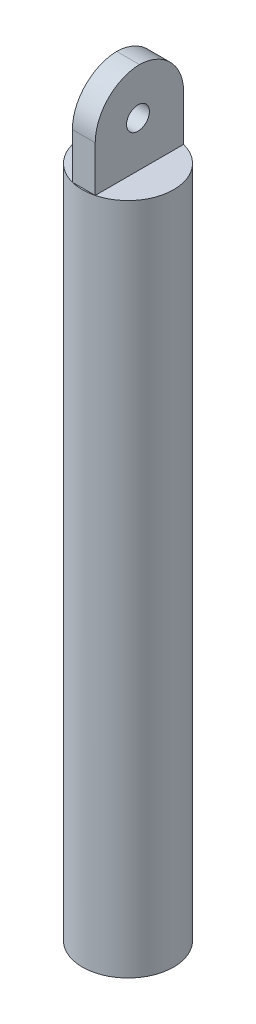
ISO-10303-21;
HEADER;
FILE_DESCRIPTION(('STEP AP214'),'2;1');
FILE_NAME('part.step','',(''),(''),'','','');
FILE_SCHEMA(('AUTOMOTIVE_DESIGN { 1 0 10303 214 1 1 1 1 }'));
ENDSEC;
DATA;
#1=APPLICATION_CONTEXT('core data for automotive mechanical design processes');
#2=APPLICATION_PROTOCOL_DEFINITION('international standard','automotive_design',2000,#1);
#3=PRODUCT_CONTEXT('',#1,'mechanical');
#4=PRODUCT('Part','Part','',(#3));
#5=PRODUCT_RELATED_PRODUCT_CATEGORY('part','',(#4));
#6=PRODUCT_DEFINITION_FORMATION('','',#4);
#7=PRODUCT_DEFINITION_CONTEXT('part definition',#1,'design');
#8=PRODUCT_DEFINITION('design','',#6,#7);
#9=PRODUCT_DEFINITION_SHAPE('','',#8);
#10=(LENGTH_UNIT() NAMED_UNIT(*) SI_UNIT(.MILLI.,.METRE.));
#11=(NAMED_UNIT(*) PLANE_ANGLE_UNIT() SI_UNIT($,.RADIAN.));
#12=(NAMED_UNIT(*) SI_UNIT($,.STERADIAN.) SOLID_ANGLE_UNIT());
#13=UNCERTAINTY_MEASURE_WITH_UNIT(LENGTH_MEASURE(1.E-05),#10,'distance_accuracy_value','');
#14=(GEOMETRIC_REPRESENTATION_CONTEXT(3) GLOBAL_UNCERTAINTY_ASSIGNED_CONTEXT((#13)) GLOBAL_UNIT_ASSIGNED_CONTEXT((#10,
#11,#12)) REPRESENTATION_CONTEXT('',''));
#15=CARTESIAN_POINT('',(0.,0.,0.));
#16=DIRECTION('',(0.,0.,1.));
#17=DIRECTION('',(1.,0.,0.));
#18=AXIS2_PLACEMENT_3D('',#15,#16,#17);
#19=CARTESIAN_POINT('',(0.,190.5,0.));
#20=DIRECTION('',(0.,1.,0.));
#21=DIRECTION('',(0.,0.,1.));
#22=AXIS2_PLACEMENT_3D('',#19,#20,#21);
#23=PLANE('',#22);
#24=DIRECTION('',(0.,0.,1.));
#25=VECTOR('',#24,1.);
#26=CARTESIAN_POINT('',(-6.35,190.5,-24.5934442484171));
#27=LINE('',#26,#25);
#28=CARTESIAN_POINT('',(-6.35000000000001,190.5,-24.5934442484171));
#29=VERTEX_POINT('',#28);
#30=CARTESIAN_POINT('',(-6.35000000000001,190.5,24.5934442484171));
#31=VERTEX_POINT('',#30);
#32=EDGE_CURVE('E176',#29,#31,#27,.T.);
#33=ORIENTED_EDGE('',*,*,#32,.F.);
#34=CARTESIAN_POINT('',(0.,190.5,0.));
#35=DIRECTION('',(0.,1.,0.));
#36=DIRECTION('',(0.,0.,1.));
#37=AXIS2_PLACEMENT_3D('',#34,#35,#36);
#38=CIRCLE('',#37,25.4);
#39=EDGE_CURVE('E171',#29,#31,#38,.T.);
#40=ORIENTED_EDGE('',*,*,#39,.T.);
#41=EDGE_LOOP('',(#33,#40));
#42=FACE_BOUND('',#41,.T.);
#43=ADVANCED_FACE('F33',(#42),#23,.T.);
#44=DIRECTION('',(-1.,0.,0.));
#45=VECTOR('',#44,1.);
#46=CARTESIAN_POINT('',(-6.35,190.5,-24.5934442484171));
#47=LINE('',#46,#45);
#48=CARTESIAN_POINT('',(6.35,190.5,-24.5934442484171));
#49=VERTEX_POINT('',#48);
#50=EDGE_CURVE('E173',#49,#29,#47,.T.);
#51=ORIENTED_EDGE('',*,*,#50,.F.);
#52=EDGE_CURVE('E163',#49,#29,#38,.T.);
#53=ORIENTED_EDGE('',*,*,#52,.T.);
#54=EDGE_LOOP('',(#51,#53));
#55=FACE_BOUND('',#54,.T.);
#56=ADVANCED_FACE('F606',(#55),#23,.T.);
#57=DIRECTION('',(0.,0.,-1.));
#58=VECTOR('',#57,1.);
#59=CARTESIAN_POINT('',(6.35,190.5,-24.5934442484171));
#60=LINE('',#59,#58);
#61=CARTESIAN_POINT('',(6.35,190.5,24.5934442484171));
#62=VERTEX_POINT('',#61);
#63=EDGE_CURVE('E142',#62,#49,#60,.T.);
#64=ORIENTED_EDGE('',*,*,#63,.F.);
#65=EDGE_CURVE('E156',#62,#49,#38,.T.);
#66=ORIENTED_EDGE('',*,*,#65,.T.);
#67=EDGE_LOOP('',(#64,#66));
#68=FACE_BOUND('',#67,.T.);
#69=ADVANCED_FACE('F172',(#68),#23,.T.);
#70=CARTESIAN_POINT('',(0.,-184.15,0.));
#71=DIRECTION('',(0.,1.,0.));
#72=DIRECTION('',(0.,0.,1.));
#73=AXIS2_PLACEMENT_3D('',#70,#71,#72);
#74=PLANE('',#73);
#75=CARTESIAN_POINT('',(0.,-184.15,0.));
#76=DIRECTION('',(0.,1.,0.));
#77=DIRECTION('',(0.,0.,1.));
#78=AXIS2_PLACEMENT_3D('',#75,#76,#77);
#79=CIRCLE('',#78,25.4);
#80=CARTESIAN_POINT('',(0.,-184.15,25.4));
#81=VERTEX_POINT('',#80);
#82=EDGE_CURVE('E194',#81,#81,#79,.T.);
#83=ORIENTED_EDGE('',*,*,#82,.F.);
#84=EDGE_LOOP('',(#83));
#85=FACE_BOUND('',#84,.T.);
#86=CARTESIAN_POINT('',(0.,-184.15,0.));
#87=DIRECTION('',(0.,1.,0.));
#88=DIRECTION('',(0.,0.,1.));
#89=AXIS2_PLACEMENT_3D('',#86,#87,#88);
#90=CIRCLE('',#89,12.7);
#91=CARTESIAN_POINT('',(0.,-184.15,12.7));
#92=VERTEX_POINT('',#91);
#93=EDGE_CURVE('E191',#92,#92,#90,.T.);
#94=ORIENTED_EDGE('',*,*,#93,.T.);
#95=EDGE_LOOP('',(#94));
#96=FACE_BOUND('',#95,.T.);
#97=ADVANCED_FACE('F593',(#85,#96),#74,.F.);
#98=CARTESIAN_POINT('',(0.,184.15,0.));
#99=DIRECTION('',(0.,-1.,0.));
#100=DIRECTION('',(0.,0.,-1.));
#101=AXIS2_PLACEMENT_3D('',#98,#99,#100);
#102=CYLINDRICAL_SURFACE('',#101,25.4);
#103=ORIENTED_EDGE('',*,*,#82,.T.);
#104=EDGE_LOOP('',(#103));
#105=FACE_BOUND('',#104,.T.);
#106=ORIENTED_EDGE('',*,*,#65,.F.);
#107=EDGE_CURVE('E160',#31,#62,#38,.T.);
#108=ORIENTED_EDGE('',*,*,#107,.F.);
#109=ORIENTED_EDGE('',*,*,#39,.F.);
#110=ORIENTED_EDGE('',*,*,#52,.F.);
#111=EDGE_LOOP('',(#106,#108,#109,#110));
#112=FACE_BOUND('',#111,.T.);
#113=ADVANCED_FACE('F158',(#105,#112),#102,.T.);
#114=CARTESIAN_POINT('',(0.,184.15,0.));
#115=DIRECTION('',(0.,-1.,0.));
#116=DIRECTION('',(0.,0.,-1.));
#117=AXIS2_PLACEMENT_3D('',#114,#115,#116);
#118=CYLINDRICAL_SURFACE('',#117,12.7);
#119=CARTESIAN_POINT('',(0.,184.15,0.));
#120=DIRECTION('',(0.,1.,0.));
#121=DIRECTION('',(0.,0.,1.));
#122=AXIS2_PLACEMENT_3D('',#119,#120,#121);
#123=CIRCLE('',#122,12.7);
#124=CARTESIAN_POINT('',(0.,184.15,12.7));
#125=VERTEX_POINT('',#124);
#126=EDGE_CURVE('E165',#125,#125,#123,.T.);
#127=ORIENTED_EDGE('',*,*,#126,.T.);
#128=EDGE_LOOP('',(#127));
#129=FACE_BOUND('',#128,.T.);
#130=ORIENTED_EDGE('',*,*,#93,.F.);
#131=EDGE_LOOP('',(#130));
#132=FACE_BOUND('',#131,.T.);
#133=ADVANCED_FACE('F592',(#129,#132),#118,.F.);
#134=CARTESIAN_POINT('',(0.,184.15,0.));
#135=DIRECTION('',(0.,1.,0.));
#136=DIRECTION('',(0.,0.,1.));
#137=AXIS2_PLACEMENT_3D('',#134,#135,#136);
#138=PLANE('',#137);
#139=ORIENTED_EDGE('',*,*,#126,.F.);
#140=EDGE_LOOP('',(#139));
#141=FACE_BOUND('',#140,.T.);
#142=ADVANCED_FACE('F580',(#141),#138,.F.);
#143=DIRECTION('',(1.,0.,0.));
#144=VECTOR('',#143,1.);
#145=CARTESIAN_POINT('',(-6.35,190.5,24.5934442484171));
#146=LINE('',#145,#144);
#147=EDGE_CURVE('E170',#31,#62,#146,.T.);
#148=ORIENTED_EDGE('',*,*,#147,.F.);
#149=ORIENTED_EDGE('',*,*,#107,.T.);
#150=EDGE_LOOP('',(#148,#149));
#151=FACE_BOUND('',#150,.T.);
#152=ADVANCED_FACE('F169',(#151),#23,.T.);
#153=CARTESIAN_POINT('',(-6.35,241.3,-24.5934442484171));
#154=DIRECTION('',(1.,0.,0.));
#155=DIRECTION('',(0.,0.,-1.));
#156=AXIS2_PLACEMENT_3D('',#153,#154,#155);
#157=PLANE('',#156);
#158=CARTESIAN_POINT('',(-6.35,215.9,0.806555751582905));
#159=DIRECTION('',(1.,0.,0.));
#160=DIRECTION('',(0.,0.,-1.));
#161=AXIS2_PLACEMENT_3D('',#158,#159,#160);
#162=CIRCLE('',#161,6.34999999999999);
#163=CARTESIAN_POINT('',(-6.35,215.9,-5.54344424841709));
#164=VERTEX_POINT('',#163);
#165=EDGE_CURVE('E209',#164,#164,#162,.T.);
#166=ORIENTED_EDGE('',*,*,#165,.T.);
#167=EDGE_LOOP('',(#166));
#168=FACE_BOUND('',#167,.T.);
#169=DIRECTION('',(0.,-1.,0.));
#170=VECTOR('',#169,1.);
#171=CARTESIAN_POINT('',(-6.35,241.3,24.5934442484171));
#172=LINE('',#171,#170);
#173=CARTESIAN_POINT('',(-6.35,215.9,24.5934442484171));
#174=VERTEX_POINT('',#173);
#175=EDGE_CURVE('E149',#174,#31,#172,.T.);
#176=ORIENTED_EDGE('',*,*,#175,.F.);
#177=CARTESIAN_POINT('',(-6.35,215.9,-0.806555751582904));
#178=DIRECTION('',(1.,0.,0.));
#179=DIRECTION('',(0.,0.,-1.));
#180=AXIS2_PLACEMENT_3D('',#177,#178,#179);
#181=CIRCLE('',#180,25.4);
#182=CARTESIAN_POINT('',(-6.35,241.287191018693,0.));
#183=VERTEX_POINT('',#182);
#184=EDGE_CURVE('E107',#174,#183,#181,.F.);
#185=ORIENTED_EDGE('',*,*,#184,.T.);
#186=CARTESIAN_POINT('',(-6.35,215.9,0.806555751582904));
#187=DIRECTION('',(1.,0.,0.));
#188=DIRECTION('',(0.,0.,-1.));
#189=AXIS2_PLACEMENT_3D('',#186,#187,#188);
#190=CIRCLE('',#189,25.4);
#191=CARTESIAN_POINT('',(-6.35,215.9,-24.5934442484171));
#192=VERTEX_POINT('',#191);
#193=EDGE_CURVE('E111',#183,#192,#190,.F.);
#194=ORIENTED_EDGE('',*,*,#193,.T.);
#195=DIRECTION('',(0.,-1.,0.));
#196=VECTOR('',#195,1.);
#197=CARTESIAN_POINT('',(-6.35,241.3,-24.5934442484171));
#198=LINE('',#197,#196);
#199=EDGE_CURVE('E185',#192,#29,#198,.T.);
#200=ORIENTED_EDGE('',*,*,#199,.T.);
#201=ORIENTED_EDGE('',*,*,#32,.T.);
#202=EDGE_LOOP('',(#176,#185,#194,#200,#201));
#203=FACE_BOUND('',#202,.T.);
#204=ADVANCED_FACE('F538',(#168,#203),#157,.F.);
#205=CARTESIAN_POINT('',(-6.35,241.3,24.5934442484171));
#206=DIRECTION('',(0.,0.,-1.));
#207=DIRECTION('',(-1.,0.,0.));
#208=AXIS2_PLACEMENT_3D('',#205,#206,#207);
#209=PLANE('',#208);
#210=DIRECTION('',(0.,-1.,0.));
#211=VECTOR('',#210,1.);
#212=CARTESIAN_POINT('',(6.35,241.3,24.5934442484171));
#213=LINE('',#212,#211);
#214=CARTESIAN_POINT('',(6.35,215.9,24.5934442484171));
#215=VERTEX_POINT('',#214);
#216=EDGE_CURVE('E137',#215,#62,#213,.T.);
#217=ORIENTED_EDGE('',*,*,#216,.F.);
#218=DIRECTION('',(1.,0.,0.));
#219=VECTOR('',#218,1.);
#220=CARTESIAN_POINT('',(-6.35,215.9,24.5934442484171));
#221=LINE('',#220,#219);
#222=EDGE_CURVE('E200',#215,#174,#221,.F.);
#223=ORIENTED_EDGE('',*,*,#222,.T.);
#224=ORIENTED_EDGE('',*,*,#175,.T.);
#225=ORIENTED_EDGE('',*,*,#147,.T.);
#226=EDGE_LOOP('',(#217,#223,#224,#225));
#227=FACE_BOUND('',#226,.T.);
#228=ADVANCED_FACE('F175',(#227),#209,.F.);
#229=CARTESIAN_POINT('',(6.35,241.3,-24.5934442484171));
#230=DIRECTION('',(-1.,0.,0.));
#231=DIRECTION('',(0.,0.,1.));
#232=AXIS2_PLACEMENT_3D('',#229,#230,#231);
#233=PLANE('',#232);
#234=CARTESIAN_POINT('',(6.35,215.9,0.806555751582904));
#235=DIRECTION('',(1.,0.,0.));
#236=DIRECTION('',(0.,0.,-1.));
#237=AXIS2_PLACEMENT_3D('',#234,#235,#236);
#238=CIRCLE('',#237,6.34999999999999);
#239=CARTESIAN_POINT('',(6.35,215.9,-5.54344424841709));
#240=VERTEX_POINT('',#239);
#241=EDGE_CURVE('E660',#240,#240,#238,.T.);
#242=ORIENTED_EDGE('',*,*,#241,.F.);
#243=EDGE_LOOP('',(#242));
#244=FACE_BOUND('',#243,.T.);
#245=CARTESIAN_POINT('',(6.35,215.9,0.806555751582904));
#246=DIRECTION('',(-1.,0.,0.));
#247=DIRECTION('',(0.,0.,1.));
#248=AXIS2_PLACEMENT_3D('',#245,#246,#247);
#249=CIRCLE('',#248,25.4);
#250=CARTESIAN_POINT('',(6.35,215.9,-24.5934442484171));
#251=VERTEX_POINT('',#250);
#252=CARTESIAN_POINT('',(6.35,241.287191018693,0.));
#253=VERTEX_POINT('',#252);
#254=EDGE_CURVE('E197',#251,#253,#249,.F.);
#255=ORIENTED_EDGE('',*,*,#254,.T.);
#256=CARTESIAN_POINT('',(6.35,215.9,-0.806555751582904));
#257=DIRECTION('',(-1.,0.,0.));
#258=DIRECTION('',(0.,0.,1.));
#259=AXIS2_PLACEMENT_3D('',#256,#257,#258);
#260=CIRCLE('',#259,25.4);
#261=EDGE_CURVE('E144',#253,#215,#260,.F.);
#262=ORIENTED_EDGE('',*,*,#261,.T.);
#263=ORIENTED_EDGE('',*,*,#216,.T.);
#264=ORIENTED_EDGE('',*,*,#63,.T.);
#265=DIRECTION('',(0.,-1.,0.));
#266=VECTOR('',#265,1.);
#267=CARTESIAN_POINT('',(6.35,241.3,-24.5934442484171));
#268=LINE('',#267,#266);
#269=EDGE_CURVE('E150',#251,#49,#268,.T.);
#270=ORIENTED_EDGE('',*,*,#269,.F.);
#271=EDGE_LOOP('',(#255,#262,#263,#264,#270));
#272=FACE_BOUND('',#271,.T.);
#273=ADVANCED_FACE('F139',(#244,#272),#233,.F.);
#274=CARTESIAN_POINT('',(-6.35,241.3,-24.5934442484171));
#275=DIRECTION('',(0.,0.,1.));
#276=DIRECTION('',(1.,0.,0.));
#277=AXIS2_PLACEMENT_3D('',#274,#275,#276);
#278=PLANE('',#277);
#279=ORIENTED_EDGE('',*,*,#199,.F.);
#280=DIRECTION('',(-1.,0.,0.));
#281=VECTOR('',#280,1.);
#282=CARTESIAN_POINT('',(6.35,215.9,-24.5934442484171));
#283=LINE('',#282,#281);
#284=EDGE_CURVE('E204',#192,#251,#283,.F.);
#285=ORIENTED_EDGE('',*,*,#284,.T.);
#286=ORIENTED_EDGE('',*,*,#269,.T.);
#287=ORIENTED_EDGE('',*,*,#50,.T.);
#288=EDGE_LOOP('',(#279,#285,#286,#287));
#289=FACE_BOUND('',#288,.T.);
#290=ADVANCED_FACE('F528',(#289),#278,.F.);
#291=CARTESIAN_POINT('',(-6.35,215.9,0.806555751582904));
#292=DIRECTION('',(1.,0.,0.));
#293=DIRECTION('',(0.,0.,-1.));
#294=AXIS2_PLACEMENT_3D('',#291,#292,#293);
#295=CYLINDRICAL_SURFACE('',#294,25.4);
#296=ORIENTED_EDGE('',*,*,#284,.F.);
#297=ORIENTED_EDGE('',*,*,#193,.F.);
#298=DIRECTION('',(1.,0.,0.));
#299=VECTOR('',#298,1.);
#300=CARTESIAN_POINT('',(0.,241.287191018693,0.));
#301=LINE('',#300,#299);
#302=EDGE_CURVE('E179',#253,#183,#301,.F.);
#303=ORIENTED_EDGE('',*,*,#302,.F.);
#304=ORIENTED_EDGE('',*,*,#254,.F.);
#305=EDGE_LOOP('',(#296,#297,#303,#304));
#306=FACE_BOUND('',#305,.T.);
#307=ADVANCED_FACE('F231',(#306),#295,.T.);
#308=CARTESIAN_POINT('',(-6.35,215.9,-0.806555751582904));
#309=DIRECTION('',(-1.,0.,0.));
#310=DIRECTION('',(0.,0.,1.));
#311=AXIS2_PLACEMENT_3D('',#308,#309,#310);
#312=CYLINDRICAL_SURFACE('',#311,25.4);
#313=ORIENTED_EDGE('',*,*,#184,.F.);
#314=ORIENTED_EDGE('',*,*,#222,.F.);
#315=ORIENTED_EDGE('',*,*,#261,.F.);
#316=ORIENTED_EDGE('',*,*,#302,.T.);
#317=EDGE_LOOP('',(#313,#314,#315,#316));
#318=FACE_BOUND('',#317,.T.);
#319=ADVANCED_FACE('F516',(#318),#312,.T.);
#320=CARTESIAN_POINT('',(6.35,215.9,0.806555751582904));
#321=DIRECTION('',(1.,0.,0.));
#322=DIRECTION('',(0.,0.,-1.));
#323=AXIS2_PLACEMENT_3D('',#320,#321,#322);
#324=CYLINDRICAL_SURFACE('',#323,6.34999999999999);
#325=ORIENTED_EDGE('',*,*,#165,.F.);
#326=EDGE_LOOP('',(#325));
#327=FACE_BOUND('',#326,.T.);
#328=ORIENTED_EDGE('',*,*,#241,.T.);
#329=EDGE_LOOP('',(#328));
#330=FACE_BOUND('',#329,.T.);
#331=ADVANCED_FACE('F513',(#327,#330),#324,.F.);
#332=CLOSED_SHELL('',(#43,#56,#69,#97,#113,#133,#142,#152,#204,#228,#273,#290,#307,#319,#331));
#333=CARTESIAN_POINT('',(0.,187.96,0.));
#334=DIRECTION('',(0.,1.,0.));
#335=DIRECTION('',(0.,0.,1.));
#336=AXIS2_PLACEMENT_3D('',#333,#334,#335);
#337=PLANE('',#336);
#338=DIRECTION('',(0.,0.,1.));
#339=VECTOR('',#338,1.);
#340=CARTESIAN_POINT('',(-3.81,187.96,-24.5934442484171));
#341=LINE('',#340,#339);
#342=CARTESIAN_POINT('',(-3.81,187.96,-22.0534442484171));
#343=VERTEX_POINT('',#342);
#344=CARTESIAN_POINT('',(-3.81,187.96,22.0534442484171));
#345=VERTEX_POINT('',#344);
#346=EDGE_CURVE('E323',#343,#345,#341,.T.);
#347=ORIENTED_EDGE('',*,*,#346,.T.);
#348=CARTESIAN_POINT('',(-3.81,187.96,22.0534442484171));
#349=DIRECTION('',(-0.99910491263347,0.,0.0423009875968118));
#350=VECTOR('',#349,1.);
#351=LINE('',#348,#350);
#352=CARTESIAN_POINT('',(-5.71500000000001,187.96,22.1340998235754));
#353=VERTEX_POINT('',#352);
#354=EDGE_CURVE('E95',#345,#353,#351,.T.);
#355=ORIENTED_EDGE('',*,*,#354,.T.);
#356=CARTESIAN_POINT('',(0.,187.96,0.));
#357=DIRECTION('',(0.,1.,0.));
#358=DIRECTION('',(0.,0.,1.));
#359=AXIS2_PLACEMENT_3D('',#356,#357,#358);
#360=CIRCLE('',#359,22.86);
#361=CARTESIAN_POINT('',(-5.71500000000001,187.96,-22.1340998235754));
#362=VERTEX_POINT('',#361);
#363=EDGE_CURVE('E100',#362,#353,#360,.T.);
#364=ORIENTED_EDGE('',*,*,#363,.F.);
#365=CARTESIAN_POINT('',(-3.81,187.96,-22.0534442484171));
#366=DIRECTION('',(-0.99910491263347,0.,-0.0423009875968119));
#367=VECTOR('',#366,1.);
#368=LINE('',#365,#367);
#369=EDGE_CURVE('E206',#343,#362,#368,.T.);
#370=ORIENTED_EDGE('',*,*,#369,.F.);
#371=EDGE_LOOP('',(#347,#355,#364,#370));
#372=FACE_BOUND('',#371,.T.);
#373=ADVANCED_FACE('F218',(#372),#337,.F.);
#374=DIRECTION('',(-1.,0.,0.));
#375=VECTOR('',#374,1.);
#376=CARTESIAN_POINT('',(-6.35,187.96,-22.0534442484171));
#377=LINE('',#376,#375);
#378=CARTESIAN_POINT('',(3.81,187.96,-22.0534442484171));
#379=VERTEX_POINT('',#378);
#380=EDGE_CURVE('E360',#379,#343,#377,.T.);
#381=ORIENTED_EDGE('',*,*,#380,.T.);
#382=ORIENTED_EDGE('',*,*,#369,.T.);
#383=CARTESIAN_POINT('',(0.,187.96,0.));
#384=DIRECTION('',(0.,1.,0.));
#385=DIRECTION('',(0.,0.,1.));
#386=AXIS2_PLACEMENT_3D('',#383,#384,#385);
#387=CIRCLE('',#386,22.86);
#388=CARTESIAN_POINT('',(5.715,187.96,-22.1340998235754));
#389=VERTEX_POINT('',#388);
#390=EDGE_CURVE('E289',#389,#362,#387,.T.);
#391=ORIENTED_EDGE('',*,*,#390,.F.);
#392=CARTESIAN_POINT('',(3.81,187.96,-22.0534442484171));
#393=DIRECTION('',(0.99910491263347,0.,-0.0423009875968121));
#394=VECTOR('',#393,1.);
#395=LINE('',#392,#394);
#396=EDGE_CURVE('E274',#379,#389,#395,.T.);
#397=ORIENTED_EDGE('',*,*,#396,.F.);
#398=EDGE_LOOP('',(#381,#382,#391,#397));
#399=FACE_BOUND('',#398,.T.);
#400=ADVANCED_FACE('F228',(#399),#337,.F.);
#401=DIRECTION('',(0.,0.,-1.));
#402=VECTOR('',#401,1.);
#403=CARTESIAN_POINT('',(3.81,187.96,-24.5934442484171));
#404=LINE('',#403,#402);
#405=CARTESIAN_POINT('',(3.81,187.96,22.0534442484171));
#406=VERTEX_POINT('',#405);
#407=EDGE_CURVE('E287',#406,#379,#404,.T.);
#408=ORIENTED_EDGE('',*,*,#407,.T.);
#409=ORIENTED_EDGE('',*,*,#396,.T.);
#410=CARTESIAN_POINT('',(0.,187.96,0.));
#411=DIRECTION('',(0.,1.,0.));
#412=DIRECTION('',(0.,0.,1.));
#413=AXIS2_PLACEMENT_3D('',#410,#411,#412);
#414=CIRCLE('',#413,22.86);
#415=CARTESIAN_POINT('',(5.715,187.96,22.1340998235754));
#416=VERTEX_POINT('',#415);
#417=EDGE_CURVE('E288',#416,#389,#414,.T.);
#418=ORIENTED_EDGE('',*,*,#417,.F.);
#419=CARTESIAN_POINT('',(3.81,187.96,22.0534442484171));
#420=DIRECTION('',(0.99910491263347,0.,0.0423009875968121));
#421=VECTOR('',#420,1.);
#422=LINE('',#419,#421);
#423=EDGE_CURVE('E283',#406,#416,#422,.T.);
#424=ORIENTED_EDGE('',*,*,#423,.F.);
#425=EDGE_LOOP('',(#408,#409,#418,#424));
#426=FACE_BOUND('',#425,.T.);
#427=ADVANCED_FACE('F285',(#426),#337,.F.);
#428=CARTESIAN_POINT('',(0.,-181.61,0.));
#429=DIRECTION('',(0.,1.,0.));
#430=DIRECTION('',(0.,0.,1.));
#431=AXIS2_PLACEMENT_3D('',#428,#429,#430);
#432=PLANE('',#431);
#433=CARTESIAN_POINT('',(0.,-181.61,0.));
#434=DIRECTION('',(0.,1.,0.));
#435=DIRECTION('',(0.,0.,1.));
#436=AXIS2_PLACEMENT_3D('',#433,#434,#435);
#437=CIRCLE('',#436,22.86);
#438=CARTESIAN_POINT('',(0.,-181.61,22.86));
#439=VERTEX_POINT('',#438);
#440=EDGE_CURVE('E345',#439,#439,#437,.T.);
#441=ORIENTED_EDGE('',*,*,#440,.T.);
#442=EDGE_LOOP('',(#441));
#443=FACE_BOUND('',#442,.T.);
#444=CARTESIAN_POINT('',(0.,-181.61,0.));
#445=DIRECTION('',(0.,1.,0.));
#446=DIRECTION('',(0.,0.,1.));
#447=AXIS2_PLACEMENT_3D('',#444,#445,#446);
#448=CIRCLE('',#447,15.24);
#449=CARTESIAN_POINT('',(0.,-181.61,15.24));
#450=VERTEX_POINT('',#449);
#451=EDGE_CURVE('E348',#450,#450,#448,.T.);
#452=ORIENTED_EDGE('',*,*,#451,.F.);
#453=EDGE_LOOP('',(#452));
#454=FACE_BOUND('',#453,.T.);
#455=ADVANCED_FACE('F233',(#443,#454),#432,.T.);
#456=CARTESIAN_POINT('',(0.,184.15,0.));
#457=DIRECTION('',(0.,-1.,0.));
#458=DIRECTION('',(0.,0.,-1.));
#459=AXIS2_PLACEMENT_3D('',#456,#457,#458);
#460=CYLINDRICAL_SURFACE('',#459,22.86);
#461=ORIENTED_EDGE('',*,*,#440,.F.);
#462=EDGE_LOOP('',(#461));
#463=FACE_BOUND('',#462,.T.);
#464=ORIENTED_EDGE('',*,*,#417,.T.);
#465=ORIENTED_EDGE('',*,*,#390,.T.);
#466=ORIENTED_EDGE('',*,*,#363,.T.);
#467=CARTESIAN_POINT('',(0.,187.96,0.));
#468=DIRECTION('',(0.,1.,0.));
#469=DIRECTION('',(0.,0.,1.));
#470=AXIS2_PLACEMENT_3D('',#467,#468,#469);
#471=CIRCLE('',#470,22.86);
#472=EDGE_CURVE('E338',#353,#416,#471,.T.);
#473=ORIENTED_EDGE('',*,*,#472,.T.);
#474=EDGE_LOOP('',(#464,#465,#466,#473));
#475=FACE_BOUND('',#474,.T.);
#476=ADVANCED_FACE('F469',(#463,#475),#460,.F.);
#477=CARTESIAN_POINT('',(0.,184.15,0.));
#478=DIRECTION('',(0.,-1.,0.));
#479=DIRECTION('',(0.,0.,-1.));
#480=AXIS2_PLACEMENT_3D('',#477,#478,#479);
#481=CYLINDRICAL_SURFACE('',#480,15.24);
#482=CARTESIAN_POINT('',(0.,186.69,0.));
#483=DIRECTION('',(0.,1.,0.));
#484=DIRECTION('',(0.,0.,1.));
#485=AXIS2_PLACEMENT_3D('',#482,#483,#484);
#486=CIRCLE('',#485,15.24);
#487=CARTESIAN_POINT('',(0.,186.69,15.24));
#488=VERTEX_POINT('',#487);
#489=EDGE_CURVE('E342',#488,#488,#486,.T.);
#490=ORIENTED_EDGE('',*,*,#489,.F.);
#491=EDGE_LOOP('',(#490));
#492=FACE_BOUND('',#491,.T.);
#493=ORIENTED_EDGE('',*,*,#451,.T.);
#494=EDGE_LOOP('',(#493));
#495=FACE_BOUND('',#494,.T.);
#496=ADVANCED_FACE('F460',(#492,#495),#481,.T.);
#497=CARTESIAN_POINT('',(0.,186.69,0.));
#498=DIRECTION('',(0.,1.,0.));
#499=DIRECTION('',(0.,0.,1.));
#500=AXIS2_PLACEMENT_3D('',#497,#498,#499);
#501=PLANE('',#500);
#502=ORIENTED_EDGE('',*,*,#489,.T.);
#503=EDGE_LOOP('',(#502));
#504=FACE_BOUND('',#503,.T.);
#505=ADVANCED_FACE('F375',(#504),#501,.T.);
#506=DIRECTION('',(1.,0.,0.));
#507=VECTOR('',#506,1.);
#508=CARTESIAN_POINT('',(-6.35,187.96,22.0534442484171));
#509=LINE('',#508,#507);
#510=EDGE_CURVE('E297',#345,#406,#509,.T.);
#511=ORIENTED_EDGE('',*,*,#510,.T.);
#512=ORIENTED_EDGE('',*,*,#423,.T.);
#513=ORIENTED_EDGE('',*,*,#472,.F.);
#514=ORIENTED_EDGE('',*,*,#354,.F.);
#515=EDGE_LOOP('',(#511,#512,#513,#514));
#516=FACE_BOUND('',#515,.T.);
#517=ADVANCED_FACE('F229',(#516),#337,.F.);
#518=CARTESIAN_POINT('',(-3.81,241.3,-24.5934442484171));
#519=DIRECTION('',(1.,0.,0.));
#520=DIRECTION('',(0.,0.,-1.));
#521=AXIS2_PLACEMENT_3D('',#518,#519,#520);
#522=PLANE('',#521);
#523=CARTESIAN_POINT('',(-3.81,215.9,0.806555751582905));
#524=DIRECTION('',(1.,0.,0.));
#525=DIRECTION('',(0.,0.,-1.));
#526=AXIS2_PLACEMENT_3D('',#523,#524,#525);
#527=CIRCLE('',#526,8.89);
#528=CARTESIAN_POINT('',(-3.81,215.9,-8.08344424841709));
#529=VERTEX_POINT('',#528);
#530=EDGE_CURVE('E335',#529,#529,#527,.T.);
#531=ORIENTED_EDGE('',*,*,#530,.F.);
#532=EDGE_LOOP('',(#531));
#533=FACE_BOUND('',#532,.T.);
#534=DIRECTION('',(0.,-1.,0.));
#535=VECTOR('',#534,1.);
#536=CARTESIAN_POINT('',(-3.81,241.3,22.0534442484171));
#537=LINE('',#536,#535);
#538=CARTESIAN_POINT('',(-3.81,215.9,22.0534442484171));
#539=VERTEX_POINT('',#538);
#540=EDGE_CURVE('E312',#539,#345,#537,.T.);
#541=ORIENTED_EDGE('',*,*,#540,.T.);
#542=ORIENTED_EDGE('',*,*,#346,.F.);
#543=DIRECTION('',(0.,-1.,0.));
#544=VECTOR('',#543,1.);
#545=CARTESIAN_POINT('',(-3.81,241.3,-22.0534442484171));
#546=LINE('',#545,#544);
#547=CARTESIAN_POINT('',(-3.81,215.9,-22.0534442484171));
#548=VERTEX_POINT('',#547);
#549=EDGE_CURVE('E325',#548,#343,#546,.T.);
#550=ORIENTED_EDGE('',*,*,#549,.F.);
#551=CARTESIAN_POINT('',(-3.81,215.9,0.806555751582904));
#552=DIRECTION('',(1.,0.,0.));
#553=DIRECTION('',(0.,0.,-1.));
#554=AXIS2_PLACEMENT_3D('',#551,#552,#553);
#555=CIRCLE('',#554,22.86);
#556=CARTESIAN_POINT('',(-3.81,238.745766956257,0.));
#557=VERTEX_POINT('',#556);
#558=EDGE_CURVE('E330',#557,#548,#555,.F.);
#559=ORIENTED_EDGE('',*,*,#558,.F.);
#560=CARTESIAN_POINT('',(-3.81,215.9,-0.806555751582904));
#561=DIRECTION('',(1.,0.,0.));
#562=DIRECTION('',(0.,0.,-1.));
#563=AXIS2_PLACEMENT_3D('',#560,#561,#562);
#564=CIRCLE('',#563,22.86);
#565=EDGE_CURVE('E53',#539,#557,#564,.F.);
#566=ORIENTED_EDGE('',*,*,#565,.F.);
#567=EDGE_LOOP('',(#541,#542,#550,#559,#566));
#568=FACE_BOUND('',#567,.T.);
#569=ADVANCED_FACE('F366',(#533,#568),#522,.T.);
#570=CARTESIAN_POINT('',(-6.35,241.3,22.0534442484171));
#571=DIRECTION('',(0.,0.,-1.));
#572=DIRECTION('',(-1.,0.,0.));
#573=AXIS2_PLACEMENT_3D('',#570,#571,#572);
#574=PLANE('',#573);
#575=DIRECTION('',(0.,-1.,0.));
#576=VECTOR('',#575,1.);
#577=CARTESIAN_POINT('',(3.81,241.3,22.0534442484171));
#578=LINE('',#577,#576);
#579=CARTESIAN_POINT('',(3.81,215.9,22.0534442484171));
#580=VERTEX_POINT('',#579);
#581=EDGE_CURVE('E294',#580,#406,#578,.T.);
#582=ORIENTED_EDGE('',*,*,#581,.T.);
#583=ORIENTED_EDGE('',*,*,#510,.F.);
#584=ORIENTED_EDGE('',*,*,#540,.F.);
#585=DIRECTION('',(-1.,0.,0.));
#586=VECTOR('',#585,1.);
#587=CARTESIAN_POINT('',(-6.35,215.9,22.0534442484171));
#588=LINE('',#587,#586);
#589=EDGE_CURVE('E298',#580,#539,#588,.T.);
#590=ORIENTED_EDGE('',*,*,#589,.F.);
#591=EDGE_LOOP('',(#582,#583,#584,#590));
#592=FACE_BOUND('',#591,.T.);
#593=ADVANCED_FACE('F295',(#592),#574,.T.);
#594=CARTESIAN_POINT('',(3.81,241.3,-24.5934442484171));
#595=DIRECTION('',(-1.,0.,0.));
#596=DIRECTION('',(0.,0.,1.));
#597=AXIS2_PLACEMENT_3D('',#594,#595,#596);
#598=PLANE('',#597);
#599=CARTESIAN_POINT('',(3.81,215.9,0.806555751582904));
#600=DIRECTION('',(-1.,0.,0.));
#601=DIRECTION('',(0.,0.,1.));
#602=AXIS2_PLACEMENT_3D('',#599,#600,#601);
#603=CIRCLE('',#602,8.89);
#604=CARTESIAN_POINT('',(3.81,215.9,9.6965557515829));
#605=VERTEX_POINT('',#604);
#606=EDGE_CURVE('E11',#605,#605,#603,.F.);
#607=ORIENTED_EDGE('',*,*,#606,.T.);
#608=EDGE_LOOP('',(#607));
#609=FACE_BOUND('',#608,.T.);
#610=CARTESIAN_POINT('',(3.81,215.9,0.806555751582904));
#611=DIRECTION('',(-1.,0.,0.));
#612=DIRECTION('',(0.,0.,1.));
#613=AXIS2_PLACEMENT_3D('',#610,#611,#612);
#614=CIRCLE('',#613,22.86);
#615=CARTESIAN_POINT('',(3.81,215.9,-22.0534442484171));
#616=VERTEX_POINT('',#615);
#617=CARTESIAN_POINT('',(3.81,238.745766956257,0.));
#618=VERTEX_POINT('',#617);
#619=EDGE_CURVE('E311',#616,#618,#614,.F.);
#620=ORIENTED_EDGE('',*,*,#619,.F.);
#621=DIRECTION('',(0.,-1.,0.));
#622=VECTOR('',#621,1.);
#623=CARTESIAN_POINT('',(3.81,241.3,-22.0534442484171));
#624=LINE('',#623,#622);
#625=EDGE_CURVE('E307',#616,#379,#624,.T.);
#626=ORIENTED_EDGE('',*,*,#625,.T.);
#627=ORIENTED_EDGE('',*,*,#407,.F.);
#628=ORIENTED_EDGE('',*,*,#581,.F.);
#629=CARTESIAN_POINT('',(3.81,215.9,-0.806555751582904));
#630=DIRECTION('',(-1.,0.,0.));
#631=DIRECTION('',(0.,0.,1.));
#632=AXIS2_PLACEMENT_3D('',#629,#630,#631);
#633=CIRCLE('',#632,22.86);
#634=EDGE_CURVE('E301',#618,#580,#633,.F.);
#635=ORIENTED_EDGE('',*,*,#634,.F.);
#636=EDGE_LOOP('',(#620,#626,#627,#628,#635));
#637=FACE_BOUND('',#636,.T.);
#638=ADVANCED_FACE('F305',(#609,#637),#598,.T.);
#639=CARTESIAN_POINT('',(-6.35,241.3,-22.0534442484171));
#640=DIRECTION('',(0.,0.,1.));
#641=DIRECTION('',(1.,0.,0.));
#642=AXIS2_PLACEMENT_3D('',#639,#640,#641);
#643=PLANE('',#642);
#644=ORIENTED_EDGE('',*,*,#549,.T.);
#645=ORIENTED_EDGE('',*,*,#380,.F.);
#646=ORIENTED_EDGE('',*,*,#625,.F.);
#647=DIRECTION('',(1.,0.,0.));
#648=VECTOR('',#647,1.);
#649=CARTESIAN_POINT('',(-6.35,215.9,-22.0534442484171));
#650=LINE('',#649,#648);
#651=EDGE_CURVE('E309',#548,#616,#650,.T.);
#652=ORIENTED_EDGE('',*,*,#651,.F.);
#653=EDGE_LOOP('',(#644,#645,#646,#652));
#654=FACE_BOUND('',#653,.T.);
#655=ADVANCED_FACE('F365',(#654),#643,.T.);
#656=CARTESIAN_POINT('',(-6.35,215.9,0.806555751582904));
#657=DIRECTION('',(1.,0.,0.));
#658=DIRECTION('',(0.,0.,-1.));
#659=AXIS2_PLACEMENT_3D('',#656,#657,#658);
#660=CYLINDRICAL_SURFACE('',#659,22.86);
#661=ORIENTED_EDGE('',*,*,#651,.T.);
#662=ORIENTED_EDGE('',*,*,#619,.T.);
#663=DIRECTION('',(1.,0.,0.));
#664=VECTOR('',#663,1.);
#665=CARTESIAN_POINT('',(3.81,238.745766956257,0.));
#666=LINE('',#665,#664);
#667=EDGE_CURVE('E44',#618,#557,#666,.F.);
#668=ORIENTED_EDGE('',*,*,#667,.T.);
#669=ORIENTED_EDGE('',*,*,#558,.T.);
#670=EDGE_LOOP('',(#661,#662,#668,#669));
#671=FACE_BOUND('',#670,.T.);
#672=ADVANCED_FACE('F385',(#671),#660,.F.);
#673=CARTESIAN_POINT('',(-6.35,215.9,-0.806555751582904));
#674=DIRECTION('',(-1.,0.,0.));
#675=DIRECTION('',(0.,0.,1.));
#676=AXIS2_PLACEMENT_3D('',#673,#674,#675);
#677=CYLINDRICAL_SURFACE('',#676,22.86);
#678=ORIENTED_EDGE('',*,*,#565,.T.);
#679=ORIENTED_EDGE('',*,*,#667,.F.);
#680=ORIENTED_EDGE('',*,*,#634,.T.);
#681=ORIENTED_EDGE('',*,*,#589,.T.);
#682=EDGE_LOOP('',(#678,#679,#680,#681));
#683=FACE_BOUND('',#682,.T.);
#684=ADVANCED_FACE('F387',(#683),#677,.F.);
#685=CARTESIAN_POINT('',(6.35,215.9,0.806555751582904));
#686=DIRECTION('',(1.,0.,0.));
#687=DIRECTION('',(0.,0.,-1.));
#688=AXIS2_PLACEMENT_3D('',#685,#686,#687);
#689=CYLINDRICAL_SURFACE('',#688,8.89);
#690=ORIENTED_EDGE('',*,*,#530,.T.);
#691=EDGE_LOOP('',(#690));
#692=FACE_BOUND('',#691,.T.);
#693=ORIENTED_EDGE('',*,*,#606,.F.);
#694=EDGE_LOOP('',(#693));
#695=FACE_BOUND('',#694,.T.);
#696=ADVANCED_FACE('F35',(#692,#695),#689,.T.);
#697=CLOSED_SHELL('',(#373,#400,#427,#455,#476,#496,#505,#517,#569,#593,#638,#655,#672,#684,#696));
#698=ORIENTED_CLOSED_SHELL('',*,#697,.T.);
#699=BREP_WITH_VOIDS('B2',#332,(#698));
#700=ADVANCED_BREP_SHAPE_REPRESENTATION('',(#18,#699),#14);
#701=SHAPE_DEFINITION_REPRESENTATION(#9,#700);
ENDSEC;
END-ISO-10303-21;
